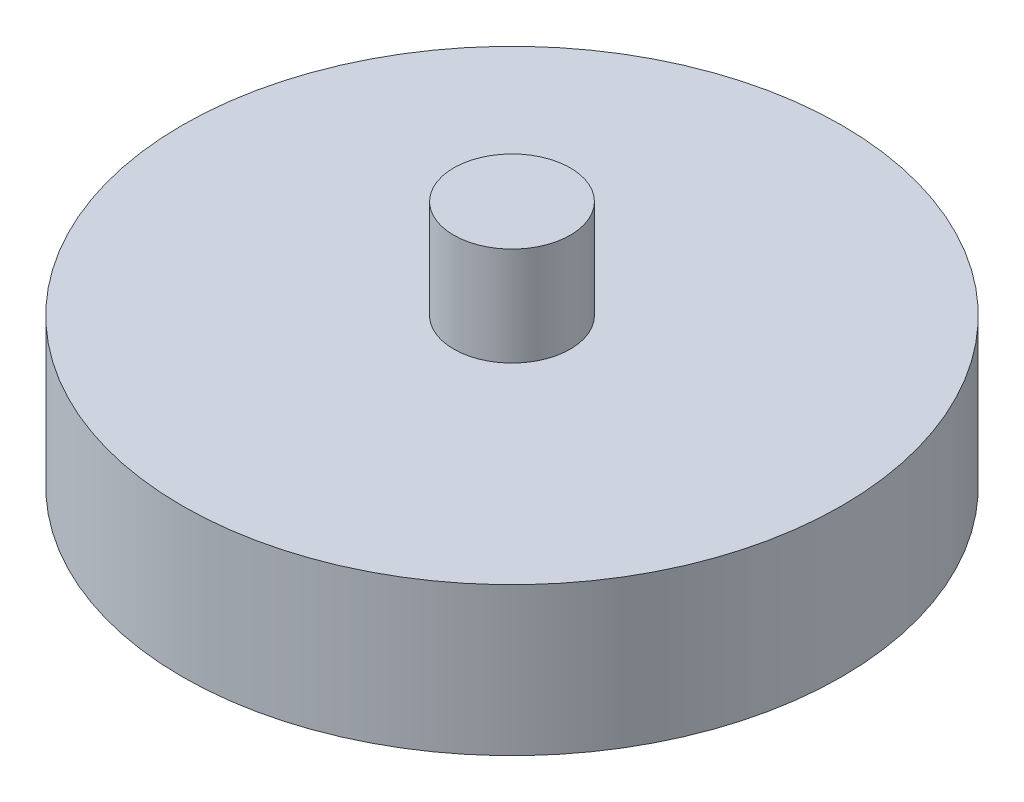
ISO-10303-21;
HEADER;
FILE_DESCRIPTION(('STEP AP214'),'2;1');
FILE_NAME('part.step','',(''),(''),'','','');
FILE_SCHEMA(('AUTOMOTIVE_DESIGN { 1 0 10303 214 1 1 1 1 }'));
ENDSEC;
DATA;
#1=APPLICATION_CONTEXT('core data for automotive mechanical design processes');
#2=APPLICATION_PROTOCOL_DEFINITION('international standard','automotive_design',2000,#1);
#3=PRODUCT_CONTEXT('',#1,'mechanical');
#4=PRODUCT('Part','Part','',(#3));
#5=PRODUCT_RELATED_PRODUCT_CATEGORY('part','',(#4));
#6=PRODUCT_DEFINITION_FORMATION('','',#4);
#7=PRODUCT_DEFINITION_CONTEXT('part definition',#1,'design');
#8=PRODUCT_DEFINITION('design','',#6,#7);
#9=PRODUCT_DEFINITION_SHAPE('','',#8);
#10=(LENGTH_UNIT() NAMED_UNIT(*) SI_UNIT(.MILLI.,.METRE.));
#11=(NAMED_UNIT(*) PLANE_ANGLE_UNIT() SI_UNIT($,.RADIAN.));
#12=(NAMED_UNIT(*) SI_UNIT($,.STERADIAN.) SOLID_ANGLE_UNIT());
#13=UNCERTAINTY_MEASURE_WITH_UNIT(LENGTH_MEASURE(1.E-05),#10,'distance_accuracy_value','');
#14=(GEOMETRIC_REPRESENTATION_CONTEXT(3) GLOBAL_UNCERTAINTY_ASSIGNED_CONTEXT((#13)) GLOBAL_UNIT_ASSIGNED_CONTEXT((#10,
#11,#12)) REPRESENTATION_CONTEXT('',''));
#15=CARTESIAN_POINT('',(0.,0.,0.));
#16=DIRECTION('',(0.,0.,1.));
#17=DIRECTION('',(1.,0.,0.));
#18=AXIS2_PLACEMENT_3D('',#15,#16,#17);
#19=CARTESIAN_POINT('',(0.,15.24,0.));
#20=DIRECTION('',(0.,-1.,0.));
#21=DIRECTION('',(0.,0.,-1.));
#22=AXIS2_PLACEMENT_3D('',#19,#20,#21);
#23=CYLINDRICAL_SURFACE('',#22,33.9325357065677);
#24=CARTESIAN_POINT('',(0.,15.24,0.));
#25=DIRECTION('',(0.,1.,0.));
#26=DIRECTION('',(0.,0.,1.));
#27=AXIS2_PLACEMENT_3D('',#24,#25,#26);
#28=CIRCLE('',#27,33.9325357065677);
#29=CARTESIAN_POINT('',(0.,15.24,33.9325357065677));
#30=VERTEX_POINT('',#29);
#31=EDGE_CURVE('E10',#30,#30,#28,.T.);
#32=ORIENTED_EDGE('',*,*,#31,.F.);
#33=EDGE_LOOP('',(#32));
#34=FACE_BOUND('',#33,.T.);
#35=CARTESIAN_POINT('',(0.,0.,0.));
#36=DIRECTION('',(0.,1.,0.));
#37=DIRECTION('',(0.,0.,1.));
#38=AXIS2_PLACEMENT_3D('',#35,#36,#37);
#39=CIRCLE('',#38,33.9325357065677);
#40=CARTESIAN_POINT('',(0.,0.,33.9325357065677));
#41=VERTEX_POINT('',#40);
#42=EDGE_CURVE('E38',#41,#41,#39,.T.);
#43=ORIENTED_EDGE('',*,*,#42,.T.);
#44=EDGE_LOOP('',(#43));
#45=FACE_BOUND('',#44,.T.);
#46=ADVANCED_FACE('F35',(#34,#45),#23,.T.);
#47=CARTESIAN_POINT('',(0.,15.24,0.));
#48=DIRECTION('',(0.,1.,0.));
#49=DIRECTION('',(0.,0.,1.));
#50=AXIS2_PLACEMENT_3D('',#47,#48,#49);
#51=PLANE('',#50);
#52=CARTESIAN_POINT('',(0.,15.24,0.));
#53=DIRECTION('',(0.,1.,0.));
#54=DIRECTION('',(0.,0.,1.));
#55=AXIS2_PLACEMENT_3D('',#52,#53,#54);
#56=CIRCLE('',#55,6.);
#57=CARTESIAN_POINT('',(0.,15.24,6.));
#58=VERTEX_POINT('',#57);
#59=EDGE_CURVE('E45',#58,#58,#56,.F.);
#60=ORIENTED_EDGE('',*,*,#59,.T.);
#61=EDGE_LOOP('',(#60));
#62=FACE_BOUND('',#61,.T.);
#63=ORIENTED_EDGE('',*,*,#31,.T.);
#64=EDGE_LOOP('',(#63));
#65=FACE_BOUND('',#64,.T.);
#66=ADVANCED_FACE('F72',(#62,#65),#51,.T.);
#67=CARTESIAN_POINT('',(0.,0.,0.));
#68=DIRECTION('',(0.,1.,0.));
#69=DIRECTION('',(0.,0.,1.));
#70=AXIS2_PLACEMENT_3D('',#67,#68,#69);
#71=PLANE('',#70);
#72=CARTESIAN_POINT('',(0.,0.,0.));
#73=DIRECTION('',(0.,-1.,0.));
#74=DIRECTION('',(0.,0.,-1.));
#75=AXIS2_PLACEMENT_3D('',#72,#73,#74);
#76=CIRCLE('',#75,25.4);
#77=CARTESIAN_POINT('',(0.,0.,-25.4));
#78=VERTEX_POINT('',#77);
#79=EDGE_CURVE('E53',#78,#78,#76,.T.);
#80=ORIENTED_EDGE('',*,*,#79,.F.);
#81=EDGE_LOOP('',(#80));
#82=FACE_BOUND('',#81,.T.);
#83=ORIENTED_EDGE('',*,*,#42,.F.);
#84=EDGE_LOOP('',(#83));
#85=FACE_BOUND('',#84,.T.);
#86=ADVANCED_FACE('F68',(#82,#85),#71,.F.);
#87=CARTESIAN_POINT('',(0.,25.4,0.));
#88=DIRECTION('',(0.,-1.,0.));
#89=DIRECTION('',(0.,0.,-1.));
#90=AXIS2_PLACEMENT_3D('',#87,#88,#89);
#91=CYLINDRICAL_SURFACE('',#90,6.);
#92=ORIENTED_EDGE('',*,*,#59,.F.);
#93=EDGE_LOOP('',(#92));
#94=FACE_BOUND('',#93,.T.);
#95=CARTESIAN_POINT('',(0.,25.4,0.));
#96=DIRECTION('',(0.,1.,0.));
#97=DIRECTION('',(0.,0.,1.));
#98=AXIS2_PLACEMENT_3D('',#95,#96,#97);
#99=CIRCLE('',#98,6.);
#100=CARTESIAN_POINT('',(0.,25.4,6.));
#101=VERTEX_POINT('',#100);
#102=EDGE_CURVE('E49',#101,#101,#99,.T.);
#103=ORIENTED_EDGE('',*,*,#102,.F.);
#104=EDGE_LOOP('',(#103));
#105=FACE_BOUND('',#104,.T.);
#106=ADVANCED_FACE('F71',(#94,#105),#91,.T.);
#107=CARTESIAN_POINT('',(0.,25.4,0.));
#108=DIRECTION('',(0.,1.,0.));
#109=DIRECTION('',(0.,0.,1.));
#110=AXIS2_PLACEMENT_3D('',#107,#108,#109);
#111=PLANE('',#110);
#112=ORIENTED_EDGE('',*,*,#102,.T.);
#113=EDGE_LOOP('',(#112));
#114=FACE_BOUND('',#113,.T.);
#115=ADVANCED_FACE('F64',(#114),#111,.T.);
#116=CARTESIAN_POINT('',(0.,2.54,0.));
#117=DIRECTION('',(0.,-1.,0.));
#118=DIRECTION('',(0.,0.,-1.));
#119=AXIS2_PLACEMENT_3D('',#116,#117,#118);
#120=CYLINDRICAL_SURFACE('',#119,25.4);
#121=CARTESIAN_POINT('',(0.,2.54,0.));
#122=DIRECTION('',(0.,-1.,0.));
#123=DIRECTION('',(0.,0.,-1.));
#124=AXIS2_PLACEMENT_3D('',#121,#122,#123);
#125=CIRCLE('',#124,25.4);
#126=CARTESIAN_POINT('',(0.,2.54,-25.4));
#127=VERTEX_POINT('',#126);
#128=EDGE_CURVE('E52',#127,#127,#125,.T.);
#129=ORIENTED_EDGE('',*,*,#128,.F.);
#130=EDGE_LOOP('',(#129));
#131=FACE_BOUND('',#130,.T.);
#132=ORIENTED_EDGE('',*,*,#79,.T.);
#133=EDGE_LOOP('',(#132));
#134=FACE_BOUND('',#133,.T.);
#135=ADVANCED_FACE('F61',(#131,#134),#120,.F.);
#136=CARTESIAN_POINT('',(0.,2.54,0.));
#137=DIRECTION('',(0.,-1.,0.));
#138=DIRECTION('',(0.,0.,-1.));
#139=AXIS2_PLACEMENT_3D('',#136,#137,#138);
#140=PLANE('',#139);
#141=ORIENTED_EDGE('',*,*,#128,.T.);
#142=EDGE_LOOP('',(#141));
#143=FACE_BOUND('',#142,.T.);
#144=ADVANCED_FACE('F59',(#143),#140,.T.);
#145=CLOSED_SHELL('',(#46,#66,#86,#106,#115,#135,#144));
#146=MANIFOLD_SOLID_BREP('B2',#145);
#147=ADVANCED_BREP_SHAPE_REPRESENTATION('',(#18,#146),#14);
#148=SHAPE_DEFINITION_REPRESENTATION(#9,#147);
ENDSEC;
END-ISO-10303-21;
